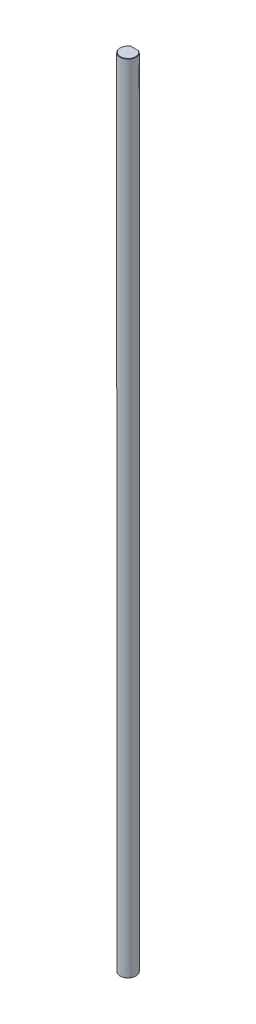
ISO-10303-21;
HEADER;
FILE_DESCRIPTION(('STEP AP214'),'2;1');
FILE_NAME('part.step','',(''),(''),'','','');
FILE_SCHEMA(('AUTOMOTIVE_DESIGN { 1 0 10303 214 1 1 1 1 }'));
ENDSEC;
DATA;
#1=APPLICATION_CONTEXT('core data for automotive mechanical design processes');
#2=APPLICATION_PROTOCOL_DEFINITION('international standard','automotive_design',2000,#1);
#3=PRODUCT_CONTEXT('',#1,'mechanical');
#4=PRODUCT('Part','Part','',(#3));
#5=PRODUCT_RELATED_PRODUCT_CATEGORY('part','',(#4));
#6=PRODUCT_DEFINITION_FORMATION('','',#4);
#7=PRODUCT_DEFINITION_CONTEXT('part definition',#1,'design');
#8=PRODUCT_DEFINITION('design','',#6,#7);
#9=PRODUCT_DEFINITION_SHAPE('','',#8);
#10=(LENGTH_UNIT() NAMED_UNIT(*) SI_UNIT(.MILLI.,.METRE.));
#11=(NAMED_UNIT(*) PLANE_ANGLE_UNIT() SI_UNIT($,.RADIAN.));
#12=(NAMED_UNIT(*) SI_UNIT($,.STERADIAN.) SOLID_ANGLE_UNIT());
#13=UNCERTAINTY_MEASURE_WITH_UNIT(LENGTH_MEASURE(1.E-05),#10,'distance_accuracy_value','');
#14=(GEOMETRIC_REPRESENTATION_CONTEXT(3) GLOBAL_UNCERTAINTY_ASSIGNED_CONTEXT((#13)) GLOBAL_UNIT_ASSIGNED_CONTEXT((#10,
#11,#12)) REPRESENTATION_CONTEXT('',''));
#15=CARTESIAN_POINT('',(0.,0.,0.));
#16=DIRECTION('',(0.,0.,1.));
#17=DIRECTION('',(1.,0.,0.));
#18=AXIS2_PLACEMENT_3D('',#15,#16,#17);
#19=CARTESIAN_POINT('',(0.,300.,0.));
#20=DIRECTION('',(0.,-1.,0.));
#21=DIRECTION('',(0.,0.,-1.));
#22=AXIS2_PLACEMENT_3D('',#19,#20,#21);
#23=CONICAL_SURFACE('',#22,2.875,0.78539816339744);
#24=CARTESIAN_POINT('',(-1.6583123951777,299.875,-2.5));
#25=CARTESIAN_POINT('',(-1.57973572193477,299.918434890403,-2.5));
#26=CARTESIAN_POINT('',(-1.50022900034243,299.960246696464,-2.5));
#27=CARTESIAN_POINT('',(-1.4197270864501,300.,-2.5));
#28=(BOUNDED_CURVE() B_SPLINE_CURVE(3,(#24,#25,#26,#27),.UNSPECIFIED.,.F.,
.F.) B_SPLINE_CURVE_WITH_KNOTS((4,4),(0.,0.000269347265701059),
.UNSPECIFIED.) CURVE() GEOMETRIC_REPRESENTATION_ITEM() RATIONAL_B_SPLINE_CURVE((1.,1.,1.,1.)) REPRESENTATION_ITEM(''));
#29=CARTESIAN_POINT('',(-1.6583123951777,299.875,-2.5));
#30=VERTEX_POINT('',#29);
#31=CARTESIAN_POINT('',(-1.4197270864501,300.,-2.5));
#32=VERTEX_POINT('',#31);
#33=EDGE_CURVE('E78',#30,#32,#28,.T.);
#34=ORIENTED_EDGE('',*,*,#33,.F.);
#35=CARTESIAN_POINT('',(0.,299.875,0.));
#36=DIRECTION('',(0.,-1.,0.));
#37=DIRECTION('',(0.,0.,1.));
#38=AXIS2_PLACEMENT_3D('',#35,#36,#37);
#39=CIRCLE('',#38,3.);
#40=CARTESIAN_POINT('',(1.6583123951777,299.875,-2.5));
#41=VERTEX_POINT('',#40);
#42=EDGE_CURVE('E80',#41,#30,#39,.T.);
#43=ORIENTED_EDGE('',*,*,#42,.F.);
#44=CARTESIAN_POINT('',(1.4197270864501,300.,-2.5));
#45=CARTESIAN_POINT('',(1.50022900034241,299.960246696464,-2.5));
#46=CARTESIAN_POINT('',(1.57973572193477,299.918434890403,-2.5));
#47=CARTESIAN_POINT('',(1.6583123951777,299.875,-2.5));
#48=(BOUNDED_CURVE() B_SPLINE_CURVE(3,(#44,#45,#46,#47),.UNSPECIFIED.,.F.,
.F.) B_SPLINE_CURVE_WITH_KNOTS((4,4),(0.,0.000269347265701066),
.UNSPECIFIED.) CURVE() GEOMETRIC_REPRESENTATION_ITEM() RATIONAL_B_SPLINE_CURVE((1.,1.,1.,1.)) REPRESENTATION_ITEM(''));
#49=CARTESIAN_POINT('',(1.4197270864501,300.,-2.5));
#50=VERTEX_POINT('',#49);
#51=EDGE_CURVE('E115',#50,#41,#48,.T.);
#52=ORIENTED_EDGE('',*,*,#51,.F.);
#53=CARTESIAN_POINT('',(0.,300.,0.));
#54=DIRECTION('',(0.,1.,0.));
#55=DIRECTION('',(0.,0.,1.));
#56=AXIS2_PLACEMENT_3D('',#53,#54,#55);
#57=CIRCLE('',#56,2.875);
#58=EDGE_CURVE('E30',#32,#50,#57,.T.);
#59=ORIENTED_EDGE('',*,*,#58,.F.);
#60=EDGE_LOOP('',(#34,#43,#52,#59));
#61=FACE_BOUND('',#60,.T.);
#62=ADVANCED_FACE('F17',(#61),#23,.T.);
#63=CARTESIAN_POINT('',(0.,0.124999999999931,0.));
#64=DIRECTION('',(0.,1.,0.));
#65=DIRECTION('',(0.,0.,1.));
#66=AXIS2_PLACEMENT_3D('',#63,#64,#65);
#67=CONICAL_SURFACE('',#66,3.,0.785398163397438);
#68=DIRECTION('',(0.,0.707106781186555,0.70710678118654));
#69=VECTOR('',#68,1.);
#70=CARTESIAN_POINT('',(0.,0.124999999999931,3.));
#71=LINE('',#70,#69);
#72=CARTESIAN_POINT('',(0.,0.,2.87500000000008));
#73=VERTEX_POINT('',#72);
#74=CARTESIAN_POINT('',(0.,0.124999999999931,3.));
#75=VERTEX_POINT('',#74);
#76=EDGE_CURVE('E320',#73,#75,#71,.T.);
#77=ORIENTED_EDGE('',*,*,#76,.F.);
#78=CARTESIAN_POINT('',(0.,0.,0.));
#79=DIRECTION('',(0.,-1.,0.));
#80=DIRECTION('',(0.,0.,1.));
#81=AXIS2_PLACEMENT_3D('',#78,#79,#80);
#82=CIRCLE('',#81,2.87500000000008);
#83=CARTESIAN_POINT('',(1.41972708645021,0.,-2.5));
#84=VERTEX_POINT('',#83);
#85=EDGE_CURVE('E11',#84,#73,#82,.T.);
#86=ORIENTED_EDGE('',*,*,#85,.F.);
#87=CARTESIAN_POINT('',(1.6583123951777,0.124999999999931,-2.5));
#88=CARTESIAN_POINT('',(1.5797357219348,0.0815651095964221,-2.5));
#89=CARTESIAN_POINT('',(1.50022900034249,0.0397533035352561,-2.5));
#90=CARTESIAN_POINT('',(1.41972708645021,0.,-2.5));
#91=(BOUNDED_CURVE() B_SPLINE_CURVE(3,(#87,#88,#89,#90),.UNSPECIFIED.,.F.,
.F.) B_SPLINE_CURVE_WITH_KNOTS((4,4),(0.,0.000269347265700939),
.UNSPECIFIED.) CURVE() GEOMETRIC_REPRESENTATION_ITEM() RATIONAL_B_SPLINE_CURVE((1.,1.,1.,1.)) REPRESENTATION_ITEM(''));
#92=CARTESIAN_POINT('',(1.6583123951777,0.124999999999931,-2.5));
#93=VERTEX_POINT('',#92);
#94=EDGE_CURVE('E21',#93,#84,#91,.T.);
#95=ORIENTED_EDGE('',*,*,#94,.F.);
#96=CARTESIAN_POINT('',(0.,0.124999999999931,0.));
#97=DIRECTION('',(0.,1.,0.));
#98=DIRECTION('',(0.,0.,1.));
#99=AXIS2_PLACEMENT_3D('',#96,#97,#98);
#100=CIRCLE('',#99,3.);
#101=EDGE_CURVE('E104',#75,#93,#100,.T.);
#102=ORIENTED_EDGE('',*,*,#101,.F.);
#103=EDGE_LOOP('',(#77,#86,#95,#102));
#104=FACE_BOUND('',#103,.T.);
#105=ADVANCED_FACE('F178',(#104),#67,.T.);
#106=CARTESIAN_POINT('',(0.,0.,0.));
#107=DIRECTION('',(0.,1.,0.));
#108=DIRECTION('',(1.,0.,0.));
#109=AXIS2_PLACEMENT_3D('',#106,#107,#108);
#110=PLANE('',#109);
#111=DIRECTION('',(1.,0.,0.));
#112=VECTOR('',#111,1.);
#113=CARTESIAN_POINT('',(0.,0.,-2.5));
#114=LINE('',#113,#112);
#115=CARTESIAN_POINT('',(-1.41972708645021,0.,-2.5));
#116=VERTEX_POINT('',#115);
#117=EDGE_CURVE('E87',#116,#84,#114,.T.);
#118=ORIENTED_EDGE('',*,*,#117,.T.);
#119=ORIENTED_EDGE('',*,*,#85,.T.);
#120=CARTESIAN_POINT('',(0.,0.,0.));
#121=DIRECTION('',(0.,-1.,0.));
#122=DIRECTION('',(0.,0.,1.));
#123=AXIS2_PLACEMENT_3D('',#120,#121,#122);
#124=CIRCLE('',#123,2.87500000000008);
#125=EDGE_CURVE('E323',#73,#116,#124,.T.);
#126=ORIENTED_EDGE('',*,*,#125,.T.);
#127=EDGE_LOOP('',(#118,#119,#126));
#128=FACE_BOUND('',#127,.T.);
#129=ADVANCED_FACE('F173',(#128),#110,.F.);
#130=CARTESIAN_POINT('',(0.,300.,0.));
#131=DIRECTION('',(0.,1.,0.));
#132=DIRECTION('',(1.,0.,0.));
#133=AXIS2_PLACEMENT_3D('',#130,#131,#132);
#134=PLANE('',#133);
#135=DIRECTION('',(1.,0.,0.));
#136=VECTOR('',#135,1.);
#137=CARTESIAN_POINT('',(0.,300.,-2.5));
#138=LINE('',#137,#136);
#139=EDGE_CURVE('E86',#32,#50,#138,.T.);
#140=ORIENTED_EDGE('',*,*,#139,.F.);
#141=ORIENTED_EDGE('',*,*,#58,.T.);
#142=EDGE_LOOP('',(#140,#141));
#143=FACE_BOUND('',#142,.T.);
#144=ADVANCED_FACE('F19',(#143),#134,.T.);
#145=CARTESIAN_POINT('',(0.,300.,-2.5));
#146=DIRECTION('',(0.,0.,-1.));
#147=DIRECTION('',(0.,-1.,0.));
#148=AXIS2_PLACEMENT_3D('',#145,#146,#147);
#149=PLANE('',#148);
#150=DIRECTION('',(0.,-1.,0.));
#151=VECTOR('',#150,1.);
#152=CARTESIAN_POINT('',(1.6583123951777,300.,-2.5));
#153=LINE('',#152,#151);
#154=EDGE_CURVE('E96',#41,#93,#153,.T.);
#155=ORIENTED_EDGE('',*,*,#154,.T.);
#156=ORIENTED_EDGE('',*,*,#94,.T.);
#157=ORIENTED_EDGE('',*,*,#117,.F.);
#158=CARTESIAN_POINT('',(-1.41972708645021,0.,-2.5));
#159=CARTESIAN_POINT('',(-1.50022900034248,0.0397533035352803,-2.5));
#160=CARTESIAN_POINT('',(-1.57973572193481,0.0815651095964097,-2.5));
#161=CARTESIAN_POINT('',(-1.6583123951777,0.124999999999931,-2.5));
#162=(BOUNDED_CURVE() B_SPLINE_CURVE(3,(#158,#159,#160,#161),.UNSPECIFIED.,.F.,
.F.) B_SPLINE_CURVE_WITH_KNOTS((4,4),(0.,0.000269347265700938),
.UNSPECIFIED.) CURVE() GEOMETRIC_REPRESENTATION_ITEM() RATIONAL_B_SPLINE_CURVE((1.,1.,1.,1.)) REPRESENTATION_ITEM(''));
#163=CARTESIAN_POINT('',(-1.6583123951777,0.124999999999931,-2.5));
#164=VERTEX_POINT('',#163);
#165=EDGE_CURVE('E101',#116,#164,#162,.T.);
#166=ORIENTED_EDGE('',*,*,#165,.T.);
#167=DIRECTION('',(0.,-1.,0.));
#168=VECTOR('',#167,1.);
#169=CARTESIAN_POINT('',(-1.6583123951777,300.,-2.5));
#170=LINE('',#169,#168);
#171=EDGE_CURVE('E92',#30,#164,#170,.T.);
#172=ORIENTED_EDGE('',*,*,#171,.F.);
#173=ORIENTED_EDGE('',*,*,#33,.T.);
#174=ORIENTED_EDGE('',*,*,#139,.T.);
#175=ORIENTED_EDGE('',*,*,#51,.T.);
#176=EDGE_LOOP('',(#155,#156,#157,#166,#172,#173,#174,#175));
#177=FACE_BOUND('',#176,.T.);
#178=ADVANCED_FACE('F99',(#177),#149,.T.);
#179=CARTESIAN_POINT('',(0.,300.,0.));
#180=DIRECTION('',(0.,-1.,0.));
#181=DIRECTION('',(0.,0.,-1.));
#182=AXIS2_PLACEMENT_3D('',#179,#180,#181);
#183=CYLINDRICAL_SURFACE('',#182,3.);
#184=ORIENTED_EDGE('',*,*,#171,.T.);
#185=CARTESIAN_POINT('',(0.,0.124999999999931,0.));
#186=DIRECTION('',(0.,1.,0.));
#187=DIRECTION('',(0.,0.,1.));
#188=AXIS2_PLACEMENT_3D('',#185,#186,#187);
#189=CIRCLE('',#188,3.);
#190=EDGE_CURVE('E111',#164,#75,#189,.T.);
#191=ORIENTED_EDGE('',*,*,#190,.T.);
#192=ORIENTED_EDGE('',*,*,#101,.T.);
#193=ORIENTED_EDGE('',*,*,#154,.F.);
#194=ORIENTED_EDGE('',*,*,#42,.T.);
#195=EDGE_LOOP('',(#184,#191,#192,#193,#194));
#196=FACE_BOUND('',#195,.T.);
#197=ADVANCED_FACE('F90',(#196),#183,.T.);
#198=CARTESIAN_POINT('',(0.,0.124999999999931,0.));
#199=DIRECTION('',(0.,1.,0.));
#200=DIRECTION('',(0.,0.,1.));
#201=AXIS2_PLACEMENT_3D('',#198,#199,#200);
#202=CONICAL_SURFACE('',#201,3.,0.785398163397438);
#203=ORIENTED_EDGE('',*,*,#125,.F.);
#204=ORIENTED_EDGE('',*,*,#76,.T.);
#205=ORIENTED_EDGE('',*,*,#190,.F.);
#206=ORIENTED_EDGE('',*,*,#165,.F.);
#207=EDGE_LOOP('',(#203,#204,#205,#206));
#208=FACE_BOUND('',#207,.T.);
#209=ADVANCED_FACE('F165',(#208),#202,.T.);
#210=CLOSED_SHELL('',(#62,#105,#129,#144,#178,#197,#209));
#211=MANIFOLD_SOLID_BREP('B1',#210);
#212=ADVANCED_BREP_SHAPE_REPRESENTATION('',(#18,#211),#14);
#213=SHAPE_DEFINITION_REPRESENTATION(#9,#212);
ENDSEC;
END-ISO-10303-21;
